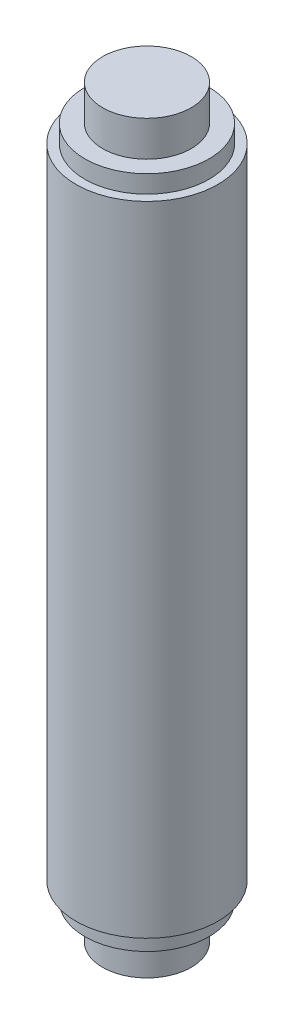
ISO-10303-21;
HEADER;
FILE_DESCRIPTION(('STEP AP214'),'2;1');
FILE_NAME('part.step','',(''),(''),'','','');
FILE_SCHEMA(('AUTOMOTIVE_DESIGN { 1 0 10303 214 1 1 1 1 }'));
ENDSEC;
DATA;
#1=APPLICATION_CONTEXT('core data for automotive mechanical design processes');
#2=APPLICATION_PROTOCOL_DEFINITION('international standard','automotive_design',2000,#1);
#3=PRODUCT_CONTEXT('',#1,'mechanical');
#4=PRODUCT('Part','Part','',(#3));
#5=PRODUCT_RELATED_PRODUCT_CATEGORY('part','',(#4));
#6=PRODUCT_DEFINITION_FORMATION('','',#4);
#7=PRODUCT_DEFINITION_CONTEXT('part definition',#1,'design');
#8=PRODUCT_DEFINITION('design','',#6,#7);
#9=PRODUCT_DEFINITION_SHAPE('','',#8);
#10=(LENGTH_UNIT() NAMED_UNIT(*) SI_UNIT(.MILLI.,.METRE.));
#11=(NAMED_UNIT(*) PLANE_ANGLE_UNIT() SI_UNIT($,.RADIAN.));
#12=(NAMED_UNIT(*) SI_UNIT($,.STERADIAN.) SOLID_ANGLE_UNIT());
#13=UNCERTAINTY_MEASURE_WITH_UNIT(LENGTH_MEASURE(1.E-05),#10,'distance_accuracy_value','');
#14=(GEOMETRIC_REPRESENTATION_CONTEXT(3) GLOBAL_UNCERTAINTY_ASSIGNED_CONTEXT((#13)) GLOBAL_UNIT_ASSIGNED_CONTEXT((#10,
#11,#12)) REPRESENTATION_CONTEXT('',''));
#15=CARTESIAN_POINT('',(0.,0.,0.));
#16=DIRECTION('',(0.,0.,1.));
#17=DIRECTION('',(1.,0.,0.));
#18=AXIS2_PLACEMENT_3D('',#15,#16,#17);
#19=CARTESIAN_POINT('',(0.,21.,0.));
#20=DIRECTION('',(0.,-1.,0.));
#21=DIRECTION('',(1.,0.,0.));
#22=AXIS2_PLACEMENT_3D('',#19,#20,#21);
#23=PLANE('',#22);
#24=CARTESIAN_POINT('',(0.,21.,0.));
#25=DIRECTION('',(0.,1.,0.));
#26=DIRECTION('',(-1.,0.,0.));
#27=AXIS2_PLACEMENT_3D('',#24,#25,#26);
#28=CIRCLE('',#27,2.5);
#29=CARTESIAN_POINT('',(-2.5,21.,0.));
#30=VERTEX_POINT('',#29);
#31=EDGE_CURVE('E10',#30,#30,#28,.T.);
#32=ORIENTED_EDGE('',*,*,#31,.T.);
#33=EDGE_LOOP('',(#32));
#34=FACE_BOUND('',#33,.T.);
#35=ADVANCED_FACE('F31',(#34),#23,.F.);
#36=CARTESIAN_POINT('',(0.,21.,0.));
#37=DIRECTION('',(0.,1.,0.));
#38=DIRECTION('',(-1.,0.,0.));
#39=AXIS2_PLACEMENT_3D('',#36,#37,#38);
#40=CYLINDRICAL_SURFACE('',#39,2.5);
#41=ORIENTED_EDGE('',*,*,#31,.F.);
#42=EDGE_LOOP('',(#41));
#43=FACE_BOUND('',#42,.T.);
#44=CARTESIAN_POINT('',(0.,19.,0.));
#45=DIRECTION('',(0.,1.,0.));
#46=DIRECTION('',(-1.,0.,0.));
#47=AXIS2_PLACEMENT_3D('',#44,#45,#46);
#48=CIRCLE('',#47,2.5);
#49=CARTESIAN_POINT('',(-2.5,19.,0.));
#50=VERTEX_POINT('',#49);
#51=EDGE_CURVE('E37',#50,#50,#48,.T.);
#52=ORIENTED_EDGE('',*,*,#51,.T.);
#53=EDGE_LOOP('',(#52));
#54=FACE_BOUND('',#53,.T.);
#55=ADVANCED_FACE('F83',(#43,#54),#40,.T.);
#56=CARTESIAN_POINT('',(2.5,19.,0.));
#57=DIRECTION('',(0.,-1.,0.));
#58=DIRECTION('',(1.,0.,0.));
#59=AXIS2_PLACEMENT_3D('',#56,#57,#58);
#60=PLANE('',#59);
#61=ORIENTED_EDGE('',*,*,#51,.F.);
#62=EDGE_LOOP('',(#61));
#63=FACE_BOUND('',#62,.T.);
#64=CARTESIAN_POINT('',(0.,19.,0.));
#65=DIRECTION('',(0.,1.,0.));
#66=DIRECTION('',(-1.,0.,0.));
#67=AXIS2_PLACEMENT_3D('',#64,#65,#66);
#68=CIRCLE('',#67,3.5);
#69=CARTESIAN_POINT('',(-3.5,19.,0.));
#70=VERTEX_POINT('',#69);
#71=EDGE_CURVE('E41',#70,#70,#68,.T.);
#72=ORIENTED_EDGE('',*,*,#71,.T.);
#73=EDGE_LOOP('',(#72));
#74=FACE_BOUND('',#73,.T.);
#75=ADVANCED_FACE('F87',(#63,#74),#60,.F.);
#76=CARTESIAN_POINT('',(0.,21.,0.));
#77=DIRECTION('',(0.,1.,0.));
#78=DIRECTION('',(-1.,0.,0.));
#79=AXIS2_PLACEMENT_3D('',#76,#77,#78);
#80=CYLINDRICAL_SURFACE('',#79,3.5);
#81=ORIENTED_EDGE('',*,*,#71,.F.);
#82=EDGE_LOOP('',(#81));
#83=FACE_BOUND('',#82,.T.);
#84=CARTESIAN_POINT('',(0.,18.,0.));
#85=DIRECTION('',(0.,1.,0.));
#86=DIRECTION('',(-1.,0.,0.));
#87=AXIS2_PLACEMENT_3D('',#84,#85,#86);
#88=CIRCLE('',#87,3.5);
#89=CARTESIAN_POINT('',(-3.5,18.,0.));
#90=VERTEX_POINT('',#89);
#91=EDGE_CURVE('E45',#90,#90,#88,.T.);
#92=ORIENTED_EDGE('',*,*,#91,.T.);
#93=EDGE_LOOP('',(#92));
#94=FACE_BOUND('',#93,.T.);
#95=ADVANCED_FACE('F92',(#83,#94),#80,.T.);
#96=CARTESIAN_POINT('',(3.5,18.,0.));
#97=DIRECTION('',(0.,-1.,0.));
#98=DIRECTION('',(1.,0.,0.));
#99=AXIS2_PLACEMENT_3D('',#96,#97,#98);
#100=PLANE('',#99);
#101=ORIENTED_EDGE('',*,*,#91,.F.);
#102=EDGE_LOOP('',(#101));
#103=FACE_BOUND('',#102,.T.);
#104=CARTESIAN_POINT('',(0.,18.,0.));
#105=DIRECTION('',(0.,1.,0.));
#106=DIRECTION('',(-1.,0.,0.));
#107=AXIS2_PLACEMENT_3D('',#104,#105,#106);
#108=CIRCLE('',#107,4.);
#109=CARTESIAN_POINT('',(-4.,18.,0.));
#110=VERTEX_POINT('',#109);
#111=EDGE_CURVE('E50',#110,#110,#108,.T.);
#112=ORIENTED_EDGE('',*,*,#111,.T.);
#113=EDGE_LOOP('',(#112));
#114=FACE_BOUND('',#113,.T.);
#115=ADVANCED_FACE('F98',(#103,#114),#100,.F.);
#116=CARTESIAN_POINT('',(0.,21.,0.));
#117=DIRECTION('',(0.,1.,0.));
#118=DIRECTION('',(-1.,0.,0.));
#119=AXIS2_PLACEMENT_3D('',#116,#117,#118);
#120=CYLINDRICAL_SURFACE('',#119,4.);
#121=ORIENTED_EDGE('',*,*,#111,.F.);
#122=EDGE_LOOP('',(#121));
#123=FACE_BOUND('',#122,.T.);
#124=CARTESIAN_POINT('',(0.,-18.,0.));
#125=DIRECTION('',(0.,1.,0.));
#126=DIRECTION('',(-1.,0.,0.));
#127=AXIS2_PLACEMENT_3D('',#124,#125,#126);
#128=CIRCLE('',#127,4.);
#129=CARTESIAN_POINT('',(-4.,-18.,0.));
#130=VERTEX_POINT('',#129);
#131=EDGE_CURVE('E65',#130,#130,#128,.T.);
#132=ORIENTED_EDGE('',*,*,#131,.T.);
#133=EDGE_LOOP('',(#132));
#134=FACE_BOUND('',#133,.T.);
#135=ADVANCED_FACE('F69',(#123,#134),#120,.T.);
#136=CARTESIAN_POINT('',(0.,-21.,0.));
#137=DIRECTION('',(0.,1.,0.));
#138=DIRECTION('',(1.,0.,0.));
#139=AXIS2_PLACEMENT_3D('',#136,#137,#138);
#140=PLANE('',#139);
#141=CARTESIAN_POINT('',(0.,-21.,0.));
#142=DIRECTION('',(0.,1.,0.));
#143=DIRECTION('',(-1.,0.,0.));
#144=AXIS2_PLACEMENT_3D('',#141,#142,#143);
#145=CIRCLE('',#144,2.5);
#146=CARTESIAN_POINT('',(-2.5,-21.,0.));
#147=VERTEX_POINT('',#146);
#148=EDGE_CURVE('E53',#147,#147,#145,.T.);
#149=ORIENTED_EDGE('',*,*,#148,.F.);
#150=EDGE_LOOP('',(#149));
#151=FACE_BOUND('',#150,.T.);
#152=ADVANCED_FACE('F105',(#151),#140,.F.);
#153=CARTESIAN_POINT('',(0.,-21.,0.));
#154=DIRECTION('',(0.,-1.,0.));
#155=DIRECTION('',(-1.,0.,0.));
#156=AXIS2_PLACEMENT_3D('',#153,#154,#155);
#157=CYLINDRICAL_SURFACE('',#156,2.5);
#158=ORIENTED_EDGE('',*,*,#148,.T.);
#159=EDGE_LOOP('',(#158));
#160=FACE_BOUND('',#159,.T.);
#161=CARTESIAN_POINT('',(0.,-19.,0.));
#162=DIRECTION('',(0.,1.,0.));
#163=DIRECTION('',(-1.,0.,0.));
#164=AXIS2_PLACEMENT_3D('',#161,#162,#163);
#165=CIRCLE('',#164,2.5);
#166=CARTESIAN_POINT('',(-2.5,-19.,0.));
#167=VERTEX_POINT('',#166);
#168=EDGE_CURVE('E56',#167,#167,#165,.T.);
#169=ORIENTED_EDGE('',*,*,#168,.F.);
#170=EDGE_LOOP('',(#169));
#171=FACE_BOUND('',#170,.T.);
#172=ADVANCED_FACE('F109',(#160,#171),#157,.T.);
#173=CARTESIAN_POINT('',(2.5,-19.,0.));
#174=DIRECTION('',(0.,1.,0.));
#175=DIRECTION('',(1.,0.,0.));
#176=AXIS2_PLACEMENT_3D('',#173,#174,#175);
#177=PLANE('',#176);
#178=ORIENTED_EDGE('',*,*,#168,.T.);
#179=EDGE_LOOP('',(#178));
#180=FACE_BOUND('',#179,.T.);
#181=CARTESIAN_POINT('',(0.,-19.,0.));
#182=DIRECTION('',(0.,1.,0.));
#183=DIRECTION('',(-1.,0.,0.));
#184=AXIS2_PLACEMENT_3D('',#181,#182,#183);
#185=CIRCLE('',#184,3.5);
#186=CARTESIAN_POINT('',(-3.5,-19.,0.));
#187=VERTEX_POINT('',#186);
#188=EDGE_CURVE('E59',#187,#187,#185,.T.);
#189=ORIENTED_EDGE('',*,*,#188,.F.);
#190=EDGE_LOOP('',(#189));
#191=FACE_BOUND('',#190,.T.);
#192=ADVANCED_FACE('F79',(#180,#191),#177,.F.);
#193=CARTESIAN_POINT('',(0.,-21.,0.));
#194=DIRECTION('',(0.,-1.,0.));
#195=DIRECTION('',(-1.,0.,0.));
#196=AXIS2_PLACEMENT_3D('',#193,#194,#195);
#197=CYLINDRICAL_SURFACE('',#196,3.5);
#198=ORIENTED_EDGE('',*,*,#188,.T.);
#199=EDGE_LOOP('',(#198));
#200=FACE_BOUND('',#199,.T.);
#201=CARTESIAN_POINT('',(0.,-18.,0.));
#202=DIRECTION('',(0.,1.,0.));
#203=DIRECTION('',(-1.,0.,0.));
#204=AXIS2_PLACEMENT_3D('',#201,#202,#203);
#205=CIRCLE('',#204,3.5);
#206=CARTESIAN_POINT('',(-3.5,-18.,0.));
#207=VERTEX_POINT('',#206);
#208=EDGE_CURVE('E62',#207,#207,#205,.T.);
#209=ORIENTED_EDGE('',*,*,#208,.F.);
#210=EDGE_LOOP('',(#209));
#211=FACE_BOUND('',#210,.T.);
#212=ADVANCED_FACE('F73',(#200,#211),#197,.T.);
#213=CARTESIAN_POINT('',(3.5,-18.,0.));
#214=DIRECTION('',(0.,1.,0.));
#215=DIRECTION('',(1.,0.,0.));
#216=AXIS2_PLACEMENT_3D('',#213,#214,#215);
#217=PLANE('',#216);
#218=ORIENTED_EDGE('',*,*,#208,.T.);
#219=EDGE_LOOP('',(#218));
#220=FACE_BOUND('',#219,.T.);
#221=ORIENTED_EDGE('',*,*,#131,.F.);
#222=EDGE_LOOP('',(#221));
#223=FACE_BOUND('',#222,.T.);
#224=ADVANCED_FACE('F71',(#220,#223),#217,.F.);
#225=CLOSED_SHELL('',(#35,#55,#75,#95,#115,#135,#152,#172,#192,#212,#224));
#226=MANIFOLD_SOLID_BREP('B2',#225);
#227=ADVANCED_BREP_SHAPE_REPRESENTATION('',(#18,#226),#14);
#228=SHAPE_DEFINITION_REPRESENTATION(#9,#227);
ENDSEC;
END-ISO-10303-21;
